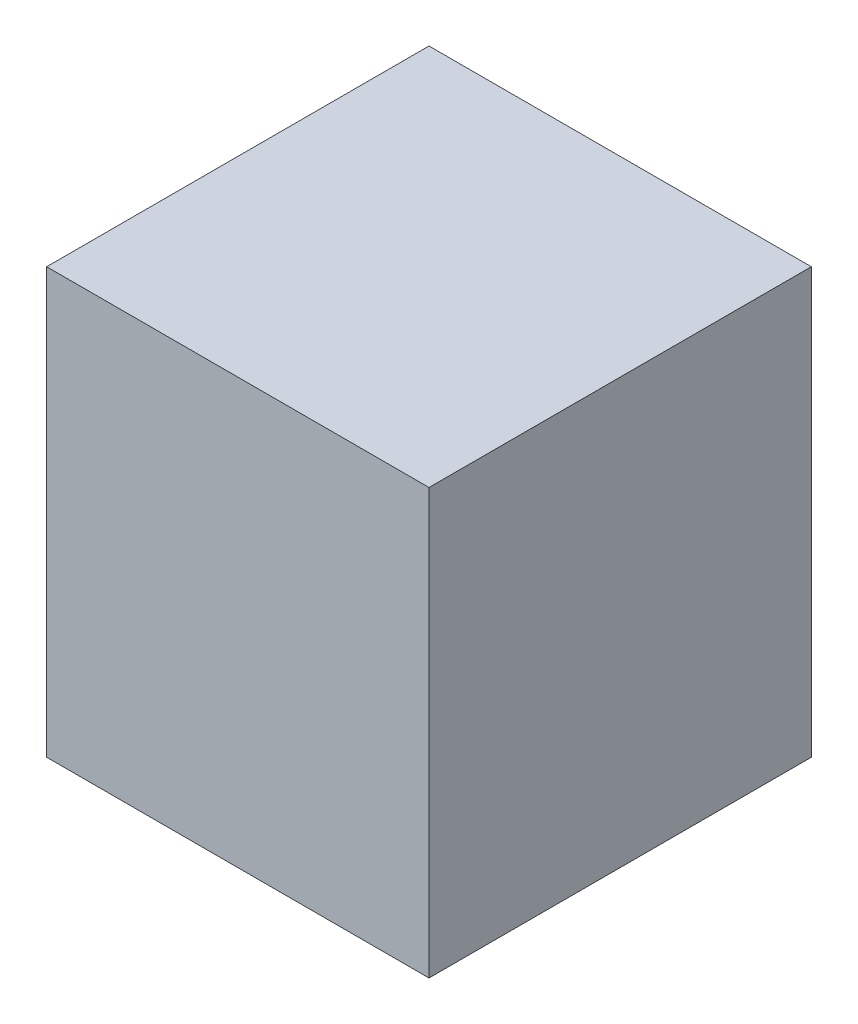
ISO-10303-21;
HEADER;
FILE_DESCRIPTION(('STEP AP214'),'2;1');
FILE_NAME('part.step','',(''),(''),'','','');
FILE_SCHEMA(('AUTOMOTIVE_DESIGN { 1 0 10303 214 1 1 1 1 }'));
ENDSEC;
DATA;
#1=APPLICATION_CONTEXT('core data for automotive mechanical design processes');
#2=APPLICATION_PROTOCOL_DEFINITION('international standard','automotive_design',2000,#1);
#3=PRODUCT_CONTEXT('',#1,'mechanical');
#4=PRODUCT('Part','Part','',(#3));
#5=PRODUCT_RELATED_PRODUCT_CATEGORY('part','',(#4));
#6=PRODUCT_DEFINITION_FORMATION('','',#4);
#7=PRODUCT_DEFINITION_CONTEXT('part definition',#1,'design');
#8=PRODUCT_DEFINITION('design','',#6,#7);
#9=PRODUCT_DEFINITION_SHAPE('','',#8);
#10=(LENGTH_UNIT() NAMED_UNIT(*) SI_UNIT(.MILLI.,.METRE.));
#11=(NAMED_UNIT(*) PLANE_ANGLE_UNIT() SI_UNIT($,.RADIAN.));
#12=(NAMED_UNIT(*) SI_UNIT($,.STERADIAN.) SOLID_ANGLE_UNIT());
#13=UNCERTAINTY_MEASURE_WITH_UNIT(LENGTH_MEASURE(1.E-05),#10,'distance_accuracy_value','');
#14=(GEOMETRIC_REPRESENTATION_CONTEXT(3) GLOBAL_UNCERTAINTY_ASSIGNED_CONTEXT((#13)) GLOBAL_UNIT_ASSIGNED_CONTEXT((#10,
#11,#12)) REPRESENTATION_CONTEXT('',''));
#15=CARTESIAN_POINT('',(0.,0.,0.));
#16=DIRECTION('',(0.,0.,1.));
#17=DIRECTION('',(1.,0.,0.));
#18=AXIS2_PLACEMENT_3D('',#15,#16,#17);
#19=CARTESIAN_POINT('',(0.4499991,0.499999,0.));
#20=DIRECTION('',(1.,0.,0.));
#21=DIRECTION('',(0.,0.,-1.));
#22=AXIS2_PLACEMENT_3D('',#19,#20,#21);
#23=PLANE('',#22);
#24=DIRECTION('',(0.,0.,-1.));
#25=VECTOR('',#24,1.);
#26=CARTESIAN_POINT('',(0.4499991,-0.499999,0.));
#27=LINE('',#26,#25);
#28=CARTESIAN_POINT('',(0.4499991,-0.499999,0.));
#29=VERTEX_POINT('',#28);
#30=CARTESIAN_POINT('',(0.4499991,-0.499999,0.90000074));
#31=VERTEX_POINT('',#30);
#32=EDGE_CURVE('E20',#29,#31,#27,.F.);
#33=ORIENTED_EDGE('',*,*,#32,.F.);
#34=DIRECTION('',(0.,1.,0.));
#35=VECTOR('',#34,1.);
#36=CARTESIAN_POINT('',(0.4499991,-0.499999,0.));
#37=LINE('',#36,#35);
#38=CARTESIAN_POINT('',(0.4499991,0.499999,0.));
#39=VERTEX_POINT('',#38);
#40=EDGE_CURVE('E79',#29,#39,#37,.T.);
#41=ORIENTED_EDGE('',*,*,#40,.T.);
#42=DIRECTION('',(0.,0.,1.));
#43=VECTOR('',#42,1.);
#44=CARTESIAN_POINT('',(0.4499991,0.499999,0.));
#45=LINE('',#44,#43);
#46=CARTESIAN_POINT('',(0.4499991,0.499999,0.90000074));
#47=VERTEX_POINT('',#46);
#48=EDGE_CURVE('E61',#47,#39,#45,.F.);
#49=ORIENTED_EDGE('',*,*,#48,.F.);
#50=DIRECTION('',(0.,1.,0.));
#51=VECTOR('',#50,1.);
#52=CARTESIAN_POINT('',(0.4499991,-0.499999,0.90000074));
#53=LINE('',#52,#51);
#54=EDGE_CURVE('E56',#31,#47,#53,.T.);
#55=ORIENTED_EDGE('',*,*,#54,.F.);
#56=EDGE_LOOP('',(#33,#41,#49,#55));
#57=FACE_BOUND('',#56,.T.);
#58=ADVANCED_FACE('F17',(#57),#23,.T.);
#59=CARTESIAN_POINT('',(0.4499991,-0.499999,0.));
#60=DIRECTION('',(0.,-1.,0.));
#61=DIRECTION('',(0.,0.,-1.));
#62=AXIS2_PLACEMENT_3D('',#59,#60,#61);
#63=PLANE('',#62);
#64=DIRECTION('',(0.,0.,1.));
#65=VECTOR('',#64,1.);
#66=CARTESIAN_POINT('',(-0.4499991,-0.499999,0.));
#67=LINE('',#66,#65);
#68=CARTESIAN_POINT('',(-0.4499991,-0.499999,0.));
#69=VERTEX_POINT('',#68);
#70=CARTESIAN_POINT('',(-0.4499991,-0.499999,0.90000074));
#71=VERTEX_POINT('',#70);
#72=EDGE_CURVE('E83',#69,#71,#67,.T.);
#73=ORIENTED_EDGE('',*,*,#72,.F.);
#74=DIRECTION('',(1.,0.,0.));
#75=VECTOR('',#74,1.);
#76=CARTESIAN_POINT('',(0.4499991,-0.499999,0.));
#77=LINE('',#76,#75);
#78=EDGE_CURVE('E68',#69,#29,#77,.T.);
#79=ORIENTED_EDGE('',*,*,#78,.T.);
#80=ORIENTED_EDGE('',*,*,#32,.T.);
#81=DIRECTION('',(1.,0.,0.));
#82=VECTOR('',#81,1.);
#83=CARTESIAN_POINT('',(0.4499991,-0.499999,0.90000074));
#84=LINE('',#83,#82);
#85=EDGE_CURVE('E63',#71,#31,#84,.T.);
#86=ORIENTED_EDGE('',*,*,#85,.F.);
#87=EDGE_LOOP('',(#73,#79,#80,#86));
#88=FACE_BOUND('',#87,.T.);
#89=ADVANCED_FACE('F65',(#88),#63,.T.);
#90=CARTESIAN_POINT('',(0.4499991,-0.499999,0.90000074));
#91=DIRECTION('',(0.,0.,1.));
#92=DIRECTION('',(1.,0.,0.));
#93=AXIS2_PLACEMENT_3D('',#90,#91,#92);
#94=PLANE('',#93);
#95=DIRECTION('',(0.,1.,0.));
#96=VECTOR('',#95,1.);
#97=CARTESIAN_POINT('',(-0.4499991,-0.499999,0.90000074));
#98=LINE('',#97,#96);
#99=CARTESIAN_POINT('',(-0.4499991,0.499999,0.90000074));
#100=VERTEX_POINT('',#99);
#101=EDGE_CURVE('E72',#71,#100,#98,.T.);
#102=ORIENTED_EDGE('',*,*,#101,.F.);
#103=ORIENTED_EDGE('',*,*,#85,.T.);
#104=ORIENTED_EDGE('',*,*,#54,.T.);
#105=DIRECTION('',(1.,0.,0.));
#106=VECTOR('',#105,1.);
#107=CARTESIAN_POINT('',(-0.4499991,0.499999,0.90000074));
#108=LINE('',#107,#106);
#109=EDGE_CURVE('E74',#100,#47,#108,.T.);
#110=ORIENTED_EDGE('',*,*,#109,.F.);
#111=EDGE_LOOP('',(#102,#103,#104,#110));
#112=FACE_BOUND('',#111,.T.);
#113=ADVANCED_FACE('F70',(#112),#94,.T.);
#114=CARTESIAN_POINT('',(-0.4499991,0.499999,0.));
#115=DIRECTION('',(0.,1.,0.));
#116=DIRECTION('',(0.,0.,1.));
#117=AXIS2_PLACEMENT_3D('',#114,#115,#116);
#118=PLANE('',#117);
#119=ORIENTED_EDGE('',*,*,#48,.T.);
#120=DIRECTION('',(1.,0.,0.));
#121=VECTOR('',#120,1.);
#122=CARTESIAN_POINT('',(0.4499991,0.499999,0.));
#123=LINE('',#122,#121);
#124=CARTESIAN_POINT('',(-0.4499991,0.499999,0.));
#125=VERTEX_POINT('',#124);
#126=EDGE_CURVE('E35',#39,#125,#123,.F.);
#127=ORIENTED_EDGE('',*,*,#126,.T.);
#128=DIRECTION('',(0.,0.,1.));
#129=VECTOR('',#128,1.);
#130=CARTESIAN_POINT('',(-0.4499991,0.499999,0.));
#131=LINE('',#130,#129);
#132=EDGE_CURVE('E26',#100,#125,#131,.F.);
#133=ORIENTED_EDGE('',*,*,#132,.F.);
#134=ORIENTED_EDGE('',*,*,#109,.T.);
#135=EDGE_LOOP('',(#119,#127,#133,#134));
#136=FACE_BOUND('',#135,.T.);
#137=ADVANCED_FACE('F89',(#136),#118,.T.);
#138=CARTESIAN_POINT('',(0.4499991,-0.499999,0.));
#139=DIRECTION('',(0.,0.,1.));
#140=DIRECTION('',(1.,0.,0.));
#141=AXIS2_PLACEMENT_3D('',#138,#139,#140);
#142=PLANE('',#141);
#143=DIRECTION('',(0.,1.,0.));
#144=VECTOR('',#143,1.);
#145=CARTESIAN_POINT('',(-0.4499991,-0.499999,0.));
#146=LINE('',#145,#144);
#147=EDGE_CURVE('E11',#125,#69,#146,.F.);
#148=ORIENTED_EDGE('',*,*,#147,.F.);
#149=ORIENTED_EDGE('',*,*,#126,.F.);
#150=ORIENTED_EDGE('',*,*,#40,.F.);
#151=ORIENTED_EDGE('',*,*,#78,.F.);
#152=EDGE_LOOP('',(#148,#149,#150,#151));
#153=FACE_BOUND('',#152,.T.);
#154=ADVANCED_FACE('F91',(#153),#142,.F.);
#155=CARTESIAN_POINT('',(-0.4499991,-0.499999,0.));
#156=DIRECTION('',(-1.,0.,0.));
#157=DIRECTION('',(0.,0.,1.));
#158=AXIS2_PLACEMENT_3D('',#155,#156,#157);
#159=PLANE('',#158);
#160=ORIENTED_EDGE('',*,*,#132,.T.);
#161=ORIENTED_EDGE('',*,*,#147,.T.);
#162=ORIENTED_EDGE('',*,*,#72,.T.);
#163=ORIENTED_EDGE('',*,*,#101,.T.);
#164=EDGE_LOOP('',(#160,#161,#162,#163));
#165=FACE_BOUND('',#164,.T.);
#166=ADVANCED_FACE('F88',(#165),#159,.T.);
#167=CLOSED_SHELL('',(#58,#89,#113,#137,#154,#166));
#168=MANIFOLD_SOLID_BREP('B1',#167);
#169=ADVANCED_BREP_SHAPE_REPRESENTATION('',(#18,#168),#14);
#170=SHAPE_DEFINITION_REPRESENTATION(#9,#169);
ENDSEC;
END-ISO-10303-21;
